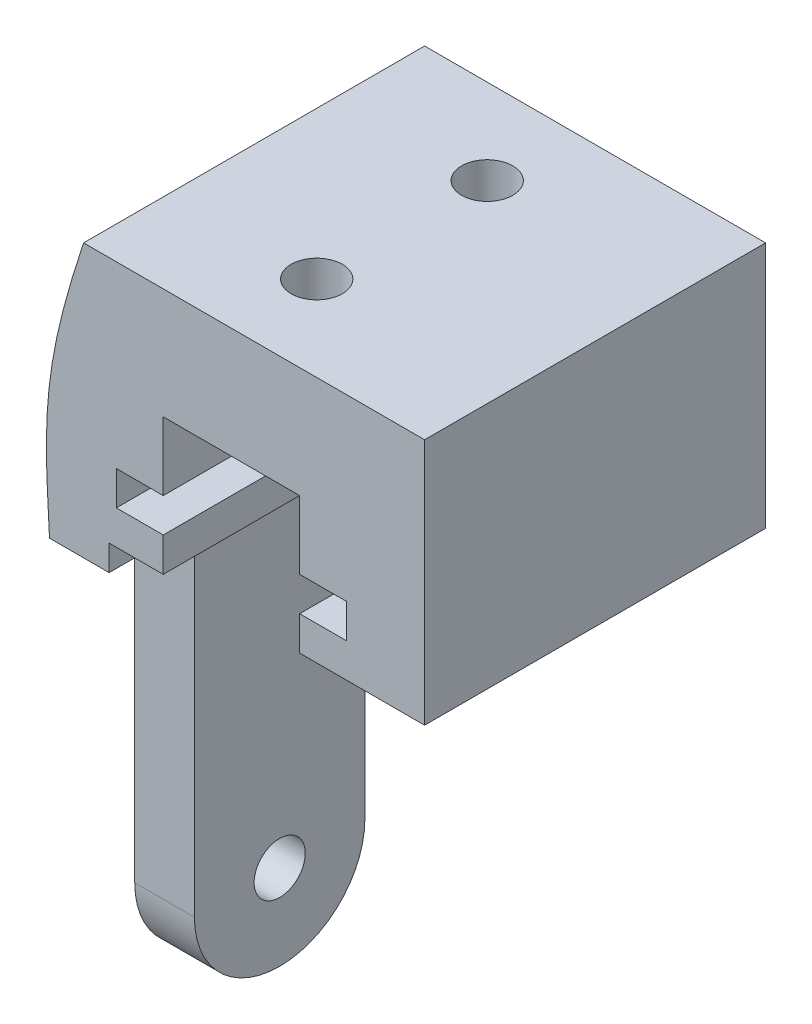
ISO-10303-21;
HEADER;
FILE_DESCRIPTION(('STEP AP214'),'2;1');
FILE_NAME('part.step','',(''),(''),'','','');
FILE_SCHEMA(('AUTOMOTIVE_DESIGN { 1 0 10303 214 1 1 1 1 }'));
ENDSEC;
DATA;
#1=APPLICATION_CONTEXT('core data for automotive mechanical design processes');
#2=APPLICATION_PROTOCOL_DEFINITION('international standard','automotive_design',2000,#1);
#3=PRODUCT_CONTEXT('',#1,'mechanical');
#4=PRODUCT('Part','Part','',(#3));
#5=PRODUCT_RELATED_PRODUCT_CATEGORY('part','',(#4));
#6=PRODUCT_DEFINITION_FORMATION('','',#4);
#7=PRODUCT_DEFINITION_CONTEXT('part definition',#1,'design');
#8=PRODUCT_DEFINITION('design','',#6,#7);
#9=PRODUCT_DEFINITION_SHAPE('','',#8);
#10=(LENGTH_UNIT() NAMED_UNIT(*) SI_UNIT(.MILLI.,.METRE.));
#11=(NAMED_UNIT(*) PLANE_ANGLE_UNIT() SI_UNIT($,.RADIAN.));
#12=(NAMED_UNIT(*) SI_UNIT($,.STERADIAN.) SOLID_ANGLE_UNIT());
#13=UNCERTAINTY_MEASURE_WITH_UNIT(LENGTH_MEASURE(1.E-05),#10,'distance_accuracy_value','');
#14=(GEOMETRIC_REPRESENTATION_CONTEXT(3) GLOBAL_UNCERTAINTY_ASSIGNED_CONTEXT((#13)) GLOBAL_UNIT_ASSIGNED_CONTEXT((#10,
#11,#12)) REPRESENTATION_CONTEXT('',''));
#15=CARTESIAN_POINT('',(0.,0.,0.));
#16=DIRECTION('',(0.,0.,1.));
#17=DIRECTION('',(1.,0.,0.));
#18=AXIS2_PLACEMENT_3D('',#15,#16,#17);
#19=CARTESIAN_POINT('',(-12.,-16.,20.));
#20=DIRECTION('',(0.,1.,0.));
#21=DIRECTION('',(-1.,0.,0.));
#22=AXIS2_PLACEMENT_3D('',#19,#20,#21);
#23=PLANE('',#22);
#24=DIRECTION('',(-1.,0.,0.));
#25=VECTOR('',#24,1.);
#26=CARTESIAN_POINT('',(-12.,-16.,15.));
#27=LINE('',#26,#25);
#28=CARTESIAN_POINT('',(-8.5,-16.,15.));
#29=VERTEX_POINT('',#28);
#30=CARTESIAN_POINT('',(-12.,-16.,15.));
#31=VERTEX_POINT('',#30);
#32=EDGE_CURVE('E217',#29,#31,#27,.T.);
#33=ORIENTED_EDGE('',*,*,#32,.F.);
#34=DIRECTION('',(0.,0.,-1.));
#35=VECTOR('',#34,1.);
#36=CARTESIAN_POINT('',(-8.5,-16.,20.));
#37=LINE('',#36,#35);
#38=CARTESIAN_POINT('',(-8.5,-16.,20.));
#39=VERTEX_POINT('',#38);
#40=EDGE_CURVE('E206',#39,#29,#37,.T.);
#41=ORIENTED_EDGE('',*,*,#40,.F.);
#42=DIRECTION('',(1.,0.,0.));
#43=VECTOR('',#42,1.);
#44=CARTESIAN_POINT('',(-12.,-16.,20.));
#45=LINE('',#44,#43);
#46=CARTESIAN_POINT('',(-12.,-16.,20.));
#47=VERTEX_POINT('',#46);
#48=EDGE_CURVE('E334',#47,#39,#45,.T.);
#49=ORIENTED_EDGE('',*,*,#48,.F.);
#50=DIRECTION('',(0.,0.,-1.));
#51=VECTOR('',#50,1.);
#52=CARTESIAN_POINT('',(-12.,-16.,20.));
#53=LINE('',#52,#51);
#54=EDGE_CURVE('E42',#47,#31,#53,.T.);
#55=ORIENTED_EDGE('',*,*,#54,.T.);
#56=EDGE_LOOP('',(#33,#41,#49,#55));
#57=FACE_BOUND('',#56,.T.);
#58=ADVANCED_FACE('F33',(#57),#23,.F.);
#59=DIRECTION('',(1.,0.,0.));
#60=VECTOR('',#59,1.);
#61=CARTESIAN_POINT('',(-12.,-16.,5.));
#62=LINE('',#61,#60);
#63=CARTESIAN_POINT('',(-12.,-16.,5.));
#64=VERTEX_POINT('',#63);
#65=CARTESIAN_POINT('',(-8.5,-16.,5.));
#66=VERTEX_POINT('',#65);
#67=EDGE_CURVE('E50',#64,#66,#62,.T.);
#68=ORIENTED_EDGE('',*,*,#67,.F.);
#69=CARTESIAN_POINT('',(-12.,-16.,0.));
#70=VERTEX_POINT('',#69);
#71=EDGE_CURVE('E226',#64,#70,#53,.T.);
#72=ORIENTED_EDGE('',*,*,#71,.T.);
#73=DIRECTION('',(1.,0.,0.));
#74=VECTOR('',#73,1.);
#75=CARTESIAN_POINT('',(-12.,-16.,0.));
#76=LINE('',#75,#74);
#77=CARTESIAN_POINT('',(-8.5,-16.,0.));
#78=VERTEX_POINT('',#77);
#79=EDGE_CURVE('E257',#70,#78,#76,.T.);
#80=ORIENTED_EDGE('',*,*,#79,.T.);
#81=EDGE_CURVE('E248',#66,#78,#37,.T.);
#82=ORIENTED_EDGE('',*,*,#81,.F.);
#83=EDGE_LOOP('',(#68,#72,#80,#82));
#84=FACE_BOUND('',#83,.T.);
#85=ADVANCED_FACE('F258',(#84),#23,.F.);
#86=CARTESIAN_POINT('',(-10.,0.,20.));
#87=DIRECTION('',(0.,1.,0.));
#88=DIRECTION('',(-1.,0.,0.));
#89=AXIS2_PLACEMENT_3D('',#86,#87,#88);
#90=PLANE('',#89);
#91=CARTESIAN_POINT('',(-1.32798457884331,0.,5.));
#92=DIRECTION('',(0.,1.,0.));
#93=DIRECTION('',(-1.,0.,0.));
#94=AXIS2_PLACEMENT_3D('',#91,#92,#93);
#95=CIRCLE('',#94,1.5);
#96=CARTESIAN_POINT('',(-2.82798457884331,0.,5.));
#97=VERTEX_POINT('',#96);
#98=EDGE_CURVE('E436',#97,#97,#95,.F.);
#99=ORIENTED_EDGE('',*,*,#98,.T.);
#100=EDGE_LOOP('',(#99));
#101=FACE_BOUND('',#100,.T.);
#102=CARTESIAN_POINT('',(-1.32798457884331,0.,15.));
#103=DIRECTION('',(0.,1.,0.));
#104=DIRECTION('',(-1.,0.,0.));
#105=AXIS2_PLACEMENT_3D('',#102,#103,#104);
#106=CIRCLE('',#105,1.5);
#107=CARTESIAN_POINT('',(-2.82798457884331,0.,15.));
#108=VERTEX_POINT('',#107);
#109=EDGE_CURVE('E429',#108,#108,#106,.F.);
#110=ORIENTED_EDGE('',*,*,#109,.T.);
#111=EDGE_LOOP('',(#110));
#112=FACE_BOUND('',#111,.T.);
#113=DIRECTION('',(1.,0.,0.));
#114=VECTOR('',#113,1.);
#115=CARTESIAN_POINT('',(-10.,0.,0.));
#116=LINE('',#115,#114);
#117=CARTESIAN_POINT('',(-10.,0.,0.));
#118=VERTEX_POINT('',#117);
#119=CARTESIAN_POINT('',(10.,0.,0.));
#120=VERTEX_POINT('',#119);
#121=EDGE_CURVE('E345',#118,#120,#116,.T.);
#122=ORIENTED_EDGE('',*,*,#121,.F.);
#123=DIRECTION('',(0.,0.,-1.));
#124=VECTOR('',#123,1.);
#125=CARTESIAN_POINT('',(-10.,0.,20.));
#126=LINE('',#125,#124);
#127=CARTESIAN_POINT('',(-10.,0.,20.));
#128=VERTEX_POINT('',#127);
#129=EDGE_CURVE('E11',#128,#118,#126,.T.);
#130=ORIENTED_EDGE('',*,*,#129,.F.);
#131=DIRECTION('',(1.,0.,0.));
#132=VECTOR('',#131,1.);
#133=CARTESIAN_POINT('',(-10.,0.,20.));
#134=LINE('',#133,#132);
#135=CARTESIAN_POINT('',(10.,0.,20.));
#136=VERTEX_POINT('',#135);
#137=EDGE_CURVE('E276',#128,#136,#134,.T.);
#138=ORIENTED_EDGE('',*,*,#137,.T.);
#139=DIRECTION('',(0.,0.,-1.));
#140=VECTOR('',#139,1.);
#141=CARTESIAN_POINT('',(10.,0.,20.));
#142=LINE('',#141,#140);
#143=EDGE_CURVE('E287',#136,#120,#142,.T.);
#144=ORIENTED_EDGE('',*,*,#143,.T.);
#145=EDGE_LOOP('',(#122,#130,#138,#144));
#146=FACE_BOUND('',#145,.T.);
#147=ADVANCED_FACE('F35',(#101,#112,#146),#90,.T.);
#148=CARTESIAN_POINT('',(-10.,0.,20.));
#149=CARTESIAN_POINT('',(-12.5766462846211,-7.74056628786684,20.));
#150=CARTESIAN_POINT('',(-12.2842806873499,-10.4923829757877,20.));
#151=CARTESIAN_POINT('',(-12.,-16.,20.));
#152=B_SPLINE_CURVE_WITH_KNOTS('',3,(#148,#149,#150,#151),.UNSPECIFIED.,.F.,.F.,(4,4),(0.,1.),.UNSPECIFIED.);
#153=DIRECTION('',(0.,0.,-1.));
#154=VECTOR('',#153,1.);
#155=SURFACE_OF_LINEAR_EXTRUSION('',#152,#154);
#156=CARTESIAN_POINT('',(-10.,0.,0.));
#157=CARTESIAN_POINT('',(-12.5766462846211,-7.74056628786684,0.));
#158=CARTESIAN_POINT('',(-12.2842806873499,-10.4923829757877,0.));
#159=CARTESIAN_POINT('',(-12.,-16.,0.));
#160=B_SPLINE_CURVE_WITH_KNOTS('',3,(#156,#157,#158,#159),.UNSPECIFIED.,.F.,.F.,(4,4),(0.,1.),.UNSPECIFIED.);
#161=EDGE_CURVE('E262',#118,#70,#160,.T.);
#162=ORIENTED_EDGE('',*,*,#161,.T.);
#163=ORIENTED_EDGE('',*,*,#71,.F.);
#164=DIRECTION('',(0.,0.,-1.));
#165=VECTOR('',#164,1.);
#166=CARTESIAN_POINT('',(-12.,-16.,15.));
#167=LINE('',#166,#165);
#168=EDGE_CURVE('E57',#31,#64,#167,.T.);
#169=ORIENTED_EDGE('',*,*,#168,.F.);
#170=ORIENTED_EDGE('',*,*,#54,.F.);
#171=EDGE_CURVE('E290',#128,#47,#152,.T.);
#172=ORIENTED_EDGE('',*,*,#171,.F.);
#173=ORIENTED_EDGE('',*,*,#129,.T.);
#174=EDGE_LOOP('',(#162,#163,#169,#170,#172,#173));
#175=FACE_BOUND('',#174,.T.);
#176=ADVANCED_FACE('F351',(#175),#155,.F.);
#177=CARTESIAN_POINT('',(-8.5,-16.,20.));
#178=DIRECTION('',(-1.,0.,0.));
#179=DIRECTION('',(0.,0.,1.));
#180=AXIS2_PLACEMENT_3D('',#177,#178,#179);
#181=PLANE('',#180);
#182=CARTESIAN_POINT('',(-8.5,-36.,10.));
#183=DIRECTION('',(-1.,0.,0.));
#184=DIRECTION('',(0.,0.,1.));
#185=AXIS2_PLACEMENT_3D('',#182,#183,#184);
#186=CIRCLE('',#185,1.5);
#187=CARTESIAN_POINT('',(-8.5,-36.,11.5));
#188=VERTEX_POINT('',#187);
#189=EDGE_CURVE('E212',#188,#188,#186,.T.);
#190=ORIENTED_EDGE('',*,*,#189,.T.);
#191=EDGE_LOOP('',(#190));
#192=FACE_BOUND('',#191,.T.);
#193=DIRECTION('',(0.,1.,0.));
#194=VECTOR('',#193,1.);
#195=CARTESIAN_POINT('',(-8.5,-16.,0.));
#196=LINE('',#195,#194);
#197=CARTESIAN_POINT('',(-8.5,-14.5,0.));
#198=VERTEX_POINT('',#197);
#199=EDGE_CURVE('E252',#78,#198,#196,.T.);
#200=ORIENTED_EDGE('',*,*,#199,.T.);
#201=DIRECTION('',(0.,0.,-1.));
#202=VECTOR('',#201,1.);
#203=CARTESIAN_POINT('',(-8.5,-14.5,20.));
#204=LINE('',#203,#202);
#205=CARTESIAN_POINT('',(-8.5,-14.5,20.));
#206=VERTEX_POINT('',#205);
#207=EDGE_CURVE('E254',#206,#198,#204,.T.);
#208=ORIENTED_EDGE('',*,*,#207,.F.);
#209=DIRECTION('',(0.,1.,0.));
#210=VECTOR('',#209,1.);
#211=CARTESIAN_POINT('',(-8.5,-16.,20.));
#212=LINE('',#211,#210);
#213=EDGE_CURVE('E332',#39,#206,#212,.T.);
#214=ORIENTED_EDGE('',*,*,#213,.F.);
#215=ORIENTED_EDGE('',*,*,#40,.T.);
#216=DIRECTION('',(0.,1.,0.));
#217=VECTOR('',#216,1.);
#218=CARTESIAN_POINT('',(-8.50000000000002,-36.,15.));
#219=LINE('',#218,#217);
#220=CARTESIAN_POINT('',(-8.5,-36.,15.));
#221=VERTEX_POINT('',#220);
#222=EDGE_CURVE('E188',#221,#29,#219,.T.);
#223=ORIENTED_EDGE('',*,*,#222,.F.);
#224=CARTESIAN_POINT('',(-8.5,-36.,10.));
#225=DIRECTION('',(-1.,0.,0.));
#226=DIRECTION('',(0.,0.,1.));
#227=AXIS2_PLACEMENT_3D('',#224,#225,#226);
#228=CIRCLE('',#227,5.);
#229=CARTESIAN_POINT('',(-8.50000000000002,-36.,5.));
#230=VERTEX_POINT('',#229);
#231=EDGE_CURVE('E202',#221,#230,#228,.F.);
#232=ORIENTED_EDGE('',*,*,#231,.T.);
#233=DIRECTION('',(0.,1.,0.));
#234=VECTOR('',#233,1.);
#235=CARTESIAN_POINT('',(-8.50000000000002,-36.,5.));
#236=LINE('',#235,#234);
#237=EDGE_CURVE('E207',#230,#66,#236,.T.);
#238=ORIENTED_EDGE('',*,*,#237,.T.);
#239=ORIENTED_EDGE('',*,*,#81,.T.);
#240=EDGE_LOOP('',(#200,#208,#214,#215,#223,#232,#238,#239));
#241=FACE_BOUND('',#240,.T.);
#242=ADVANCED_FACE('F200',(#192,#241),#181,.F.);
#243=CARTESIAN_POINT('',(-8.5,-14.5,20.));
#244=DIRECTION('',(0.,1.,0.));
#245=DIRECTION('',(0.,0.,1.));
#246=AXIS2_PLACEMENT_3D('',#243,#244,#245);
#247=PLANE('',#246);
#248=DIRECTION('',(1.,0.,0.));
#249=VECTOR('',#248,1.);
#250=CARTESIAN_POINT('',(-8.5,-14.5,0.));
#251=LINE('',#250,#249);
#252=CARTESIAN_POINT('',(-5.32798457884331,-14.5,0.));
#253=VERTEX_POINT('',#252);
#254=EDGE_CURVE('E268',#198,#253,#251,.T.);
#255=ORIENTED_EDGE('',*,*,#254,.T.);
#256=DIRECTION('',(0.,0.,-1.));
#257=VECTOR('',#256,1.);
#258=CARTESIAN_POINT('',(-5.32798457884331,-14.5,20.));
#259=LINE('',#258,#257);
#260=CARTESIAN_POINT('',(-5.32798457884331,-14.5,20.));
#261=VERTEX_POINT('',#260);
#262=EDGE_CURVE('E325',#261,#253,#259,.T.);
#263=ORIENTED_EDGE('',*,*,#262,.F.);
#264=DIRECTION('',(1.,0.,0.));
#265=VECTOR('',#264,1.);
#266=CARTESIAN_POINT('',(-8.5,-14.5,20.));
#267=LINE('',#266,#265);
#268=EDGE_CURVE('E331',#206,#261,#267,.T.);
#269=ORIENTED_EDGE('',*,*,#268,.F.);
#270=ORIENTED_EDGE('',*,*,#207,.T.);
#271=EDGE_LOOP('',(#255,#263,#269,#270));
#272=FACE_BOUND('',#271,.T.);
#273=ADVANCED_FACE('F329',(#272),#247,.F.);
#274=CARTESIAN_POINT('',(-5.32798457884331,-14.5,20.));
#275=DIRECTION('',(-1.,0.,0.));
#276=DIRECTION('',(0.,0.,1.));
#277=AXIS2_PLACEMENT_3D('',#274,#275,#276);
#278=PLANE('',#277);
#279=DIRECTION('',(0.,1.,0.));
#280=VECTOR('',#279,1.);
#281=CARTESIAN_POINT('',(-5.32798457884331,-14.5,0.));
#282=LINE('',#281,#280);
#283=CARTESIAN_POINT('',(-5.32798457884331,-12.5,0.));
#284=VERTEX_POINT('',#283);
#285=EDGE_CURVE('E270',#253,#284,#282,.T.);
#286=ORIENTED_EDGE('',*,*,#285,.T.);
#287=DIRECTION('',(0.,0.,-1.));
#288=VECTOR('',#287,1.);
#289=CARTESIAN_POINT('',(-5.32798457884331,-12.5,20.));
#290=LINE('',#289,#288);
#291=CARTESIAN_POINT('',(-5.32798457884331,-12.5,20.));
#292=VERTEX_POINT('',#291);
#293=EDGE_CURVE('E322',#292,#284,#290,.T.);
#294=ORIENTED_EDGE('',*,*,#293,.F.);
#295=DIRECTION('',(0.,1.,0.));
#296=VECTOR('',#295,1.);
#297=CARTESIAN_POINT('',(-5.32798457884331,-14.5,20.));
#298=LINE('',#297,#296);
#299=EDGE_CURVE('E337',#261,#292,#298,.T.);
#300=ORIENTED_EDGE('',*,*,#299,.F.);
#301=ORIENTED_EDGE('',*,*,#262,.T.);
#302=EDGE_LOOP('',(#286,#294,#300,#301));
#303=FACE_BOUND('',#302,.T.);
#304=ADVANCED_FACE('F364',(#303),#278,.F.);
#305=CARTESIAN_POINT('',(-5.32798457884331,-12.5,20.));
#306=DIRECTION('',(0.,-1.,0.));
#307=DIRECTION('',(1.,0.,0.));
#308=AXIS2_PLACEMENT_3D('',#305,#306,#307);
#309=PLANE('',#308);
#310=DIRECTION('',(-1.,0.,0.));
#311=VECTOR('',#310,1.);
#312=CARTESIAN_POINT('',(-5.32798457884331,-12.5,0.));
#313=LINE('',#312,#311);
#314=CARTESIAN_POINT('',(-8.07798457884331,-12.5,0.));
#315=VERTEX_POINT('',#314);
#316=EDGE_CURVE('E472',#284,#315,#313,.T.);
#317=ORIENTED_EDGE('',*,*,#316,.T.);
#318=DIRECTION('',(0.,0.,-1.));
#319=VECTOR('',#318,1.);
#320=CARTESIAN_POINT('',(-8.07798457884331,-12.5,20.));
#321=LINE('',#320,#319);
#322=CARTESIAN_POINT('',(-8.07798457884331,-12.5,20.));
#323=VERTEX_POINT('',#322);
#324=EDGE_CURVE('E319',#323,#315,#321,.T.);
#325=ORIENTED_EDGE('',*,*,#324,.F.);
#326=DIRECTION('',(-1.,0.,0.));
#327=VECTOR('',#326,1.);
#328=CARTESIAN_POINT('',(-5.32798457884331,-12.5,20.));
#329=LINE('',#328,#327);
#330=EDGE_CURVE('E464',#292,#323,#329,.T.);
#331=ORIENTED_EDGE('',*,*,#330,.F.);
#332=ORIENTED_EDGE('',*,*,#293,.T.);
#333=EDGE_LOOP('',(#317,#325,#331,#332));
#334=FACE_BOUND('',#333,.T.);
#335=ADVANCED_FACE('F367',(#334),#309,.F.);
#336=CARTESIAN_POINT('',(-8.07798457884331,-12.5,20.));
#337=DIRECTION('',(-1.,0.,0.));
#338=DIRECTION('',(0.,0.,1.));
#339=AXIS2_PLACEMENT_3D('',#336,#337,#338);
#340=PLANE('',#339);
#341=DIRECTION('',(0.,1.,0.));
#342=VECTOR('',#341,1.);
#343=CARTESIAN_POINT('',(-8.07798457884331,-12.5,0.));
#344=LINE('',#343,#342);
#345=CARTESIAN_POINT('',(-8.07798457884331,-10.5,0.));
#346=VERTEX_POINT('',#345);
#347=EDGE_CURVE('E735',#315,#346,#344,.T.);
#348=ORIENTED_EDGE('',*,*,#347,.T.);
#349=DIRECTION('',(0.,0.,-1.));
#350=VECTOR('',#349,1.);
#351=CARTESIAN_POINT('',(-8.07798457884331,-10.5,20.));
#352=LINE('',#351,#350);
#353=CARTESIAN_POINT('',(-8.07798457884331,-10.5,20.));
#354=VERTEX_POINT('',#353);
#355=EDGE_CURVE('E316',#354,#346,#352,.T.);
#356=ORIENTED_EDGE('',*,*,#355,.F.);
#357=DIRECTION('',(0.,1.,0.));
#358=VECTOR('',#357,1.);
#359=CARTESIAN_POINT('',(-8.07798457884331,-12.5,20.));
#360=LINE('',#359,#358);
#361=EDGE_CURVE('E462',#323,#354,#360,.T.);
#362=ORIENTED_EDGE('',*,*,#361,.F.);
#363=ORIENTED_EDGE('',*,*,#324,.T.);
#364=EDGE_LOOP('',(#348,#356,#362,#363));
#365=FACE_BOUND('',#364,.T.);
#366=ADVANCED_FACE('F371',(#365),#340,.F.);
#367=CARTESIAN_POINT('',(-8.07798457884331,-10.5,20.));
#368=DIRECTION('',(0.,1.,0.));
#369=DIRECTION('',(0.,0.,1.));
#370=AXIS2_PLACEMENT_3D('',#367,#368,#369);
#371=PLANE('',#370);
#372=DIRECTION('',(1.,0.,0.));
#373=VECTOR('',#372,1.);
#374=CARTESIAN_POINT('',(-8.07798457884331,-10.5,0.));
#375=LINE('',#374,#373);
#376=CARTESIAN_POINT('',(-5.32798457884331,-10.5,0.));
#377=VERTEX_POINT('',#376);
#378=EDGE_CURVE('E480',#346,#377,#375,.T.);
#379=ORIENTED_EDGE('',*,*,#378,.T.);
#380=DIRECTION('',(0.,0.,-1.));
#381=VECTOR('',#380,1.);
#382=CARTESIAN_POINT('',(-5.32798457884331,-10.5,20.));
#383=LINE('',#382,#381);
#384=CARTESIAN_POINT('',(-5.32798457884331,-10.5,20.));
#385=VERTEX_POINT('',#384);
#386=EDGE_CURVE('E313',#385,#377,#383,.T.);
#387=ORIENTED_EDGE('',*,*,#386,.F.);
#388=DIRECTION('',(1.,0.,0.));
#389=VECTOR('',#388,1.);
#390=CARTESIAN_POINT('',(-8.07798457884331,-10.5,20.));
#391=LINE('',#390,#389);
#392=EDGE_CURVE('E460',#354,#385,#391,.T.);
#393=ORIENTED_EDGE('',*,*,#392,.F.);
#394=ORIENTED_EDGE('',*,*,#355,.T.);
#395=EDGE_LOOP('',(#379,#387,#393,#394));
#396=FACE_BOUND('',#395,.T.);
#397=ADVANCED_FACE('F375',(#396),#371,.F.);
#398=CARTESIAN_POINT('',(-5.32798457884331,-10.5,20.));
#399=DIRECTION('',(-1.,0.,0.));
#400=DIRECTION('',(0.,0.,1.));
#401=AXIS2_PLACEMENT_3D('',#398,#399,#400);
#402=PLANE('',#401);
#403=DIRECTION('',(0.,1.,0.));
#404=VECTOR('',#403,1.);
#405=CARTESIAN_POINT('',(-5.32798457884331,-10.5,0.));
#406=LINE('',#405,#404);
#407=CARTESIAN_POINT('',(-5.32798457884331,-6.5,0.));
#408=VERTEX_POINT('',#407);
#409=EDGE_CURVE('E483',#377,#408,#406,.T.);
#410=ORIENTED_EDGE('',*,*,#409,.T.);
#411=DIRECTION('',(0.,0.,-1.));
#412=VECTOR('',#411,1.);
#413=CARTESIAN_POINT('',(-5.32798457884331,-6.5,20.));
#414=LINE('',#413,#412);
#415=CARTESIAN_POINT('',(-5.32798457884331,-6.5,20.));
#416=VERTEX_POINT('',#415);
#417=EDGE_CURVE('E310',#416,#408,#414,.T.);
#418=ORIENTED_EDGE('',*,*,#417,.F.);
#419=DIRECTION('',(0.,1.,0.));
#420=VECTOR('',#419,1.);
#421=CARTESIAN_POINT('',(-5.32798457884331,-10.5,20.));
#422=LINE('',#421,#420);
#423=EDGE_CURVE('E458',#385,#416,#422,.T.);
#424=ORIENTED_EDGE('',*,*,#423,.F.);
#425=ORIENTED_EDGE('',*,*,#386,.T.);
#426=EDGE_LOOP('',(#410,#418,#424,#425));
#427=FACE_BOUND('',#426,.T.);
#428=ADVANCED_FACE('F379',(#427),#402,.F.);
#429=CARTESIAN_POINT('',(-5.32798457884331,-6.5,20.));
#430=DIRECTION('',(0.,1.,0.));
#431=DIRECTION('',(-1.,0.,0.));
#432=AXIS2_PLACEMENT_3D('',#429,#430,#431);
#433=PLANE('',#432);
#434=CARTESIAN_POINT('',(-1.32798457884331,-6.5,5.));
#435=DIRECTION('',(0.,-1.,0.));
#436=DIRECTION('',(1.,0.,0.));
#437=AXIS2_PLACEMENT_3D('',#434,#435,#436);
#438=CIRCLE('',#437,1.5);
#439=CARTESIAN_POINT('',(0.172015421156694,-6.5,5.));
#440=VERTEX_POINT('',#439);
#441=EDGE_CURVE('E235',#440,#440,#438,.T.);
#442=ORIENTED_EDGE('',*,*,#441,.F.);
#443=EDGE_LOOP('',(#442));
#444=FACE_BOUND('',#443,.T.);
#445=CARTESIAN_POINT('',(-1.32798457884331,-6.5,15.));
#446=DIRECTION('',(0.,-1.,0.));
#447=DIRECTION('',(1.,0.,0.));
#448=AXIS2_PLACEMENT_3D('',#445,#446,#447);
#449=CIRCLE('',#448,1.5);
#450=CARTESIAN_POINT('',(0.172015421156694,-6.5,15.));
#451=VERTEX_POINT('',#450);
#452=EDGE_CURVE('E431',#451,#451,#449,.T.);
#453=ORIENTED_EDGE('',*,*,#452,.F.);
#454=EDGE_LOOP('',(#453));
#455=FACE_BOUND('',#454,.T.);
#456=DIRECTION('',(1.,0.,0.));
#457=VECTOR('',#456,1.);
#458=CARTESIAN_POINT('',(-5.32798457884331,-6.5,0.));
#459=LINE('',#458,#457);
#460=CARTESIAN_POINT('',(2.67201542115669,-6.5,0.));
#461=VERTEX_POINT('',#460);
#462=EDGE_CURVE('E731',#408,#461,#459,.T.);
#463=ORIENTED_EDGE('',*,*,#462,.T.);
#464=DIRECTION('',(0.,0.,-1.));
#465=VECTOR('',#464,1.);
#466=CARTESIAN_POINT('',(2.67201542115669,-6.5,20.));
#467=LINE('',#466,#465);
#468=CARTESIAN_POINT('',(2.67201542115669,-6.5,20.));
#469=VERTEX_POINT('',#468);
#470=EDGE_CURVE('E307',#469,#461,#467,.T.);
#471=ORIENTED_EDGE('',*,*,#470,.F.);
#472=DIRECTION('',(1.,0.,0.));
#473=VECTOR('',#472,1.);
#474=CARTESIAN_POINT('',(-5.32798457884331,-6.5,20.));
#475=LINE('',#474,#473);
#476=EDGE_CURVE('E456',#416,#469,#475,.T.);
#477=ORIENTED_EDGE('',*,*,#476,.F.);
#478=ORIENTED_EDGE('',*,*,#417,.T.);
#479=EDGE_LOOP('',(#463,#471,#477,#478));
#480=FACE_BOUND('',#479,.T.);
#481=ADVANCED_FACE('F383',(#444,#455,#480),#433,.F.);
#482=CARTESIAN_POINT('',(2.67201542115669,-6.5,20.));
#483=DIRECTION('',(1.,0.,0.));
#484=DIRECTION('',(0.,1.,0.));
#485=AXIS2_PLACEMENT_3D('',#482,#483,#484);
#486=PLANE('',#485);
#487=DIRECTION('',(0.,-1.,0.));
#488=VECTOR('',#487,1.);
#489=CARTESIAN_POINT('',(2.67201542115669,-6.5,0.));
#490=LINE('',#489,#488);
#491=CARTESIAN_POINT('',(2.67201542115669,-10.5,0.));
#492=VERTEX_POINT('',#491);
#493=EDGE_CURVE('E492',#461,#492,#490,.T.);
#494=ORIENTED_EDGE('',*,*,#493,.T.);
#495=DIRECTION('',(0.,0.,-1.));
#496=VECTOR('',#495,1.);
#497=CARTESIAN_POINT('',(2.67201542115669,-10.5,20.));
#498=LINE('',#497,#496);
#499=CARTESIAN_POINT('',(2.67201542115669,-10.5,20.));
#500=VERTEX_POINT('',#499);
#501=EDGE_CURVE('E304',#500,#492,#498,.T.);
#502=ORIENTED_EDGE('',*,*,#501,.F.);
#503=DIRECTION('',(0.,-1.,0.));
#504=VECTOR('',#503,1.);
#505=CARTESIAN_POINT('',(2.67201542115669,-6.5,20.));
#506=LINE('',#505,#504);
#507=EDGE_CURVE('E454',#469,#500,#506,.T.);
#508=ORIENTED_EDGE('',*,*,#507,.F.);
#509=ORIENTED_EDGE('',*,*,#470,.T.);
#510=EDGE_LOOP('',(#494,#502,#508,#509));
#511=FACE_BOUND('',#510,.T.);
#512=ADVANCED_FACE('F387',(#511),#486,.F.);
#513=CARTESIAN_POINT('',(2.67201542115669,-10.5,20.));
#514=DIRECTION('',(0.,1.,0.));
#515=DIRECTION('',(0.,0.,1.));
#516=AXIS2_PLACEMENT_3D('',#513,#514,#515);
#517=PLANE('',#516);
#518=DIRECTION('',(1.,0.,0.));
#519=VECTOR('',#518,1.);
#520=CARTESIAN_POINT('',(2.67201542115669,-10.5,0.));
#521=LINE('',#520,#519);
#522=CARTESIAN_POINT('',(5.42201542115669,-10.5,0.));
#523=VERTEX_POINT('',#522);
#524=EDGE_CURVE('E495',#492,#523,#521,.T.);
#525=ORIENTED_EDGE('',*,*,#524,.T.);
#526=DIRECTION('',(0.,0.,-1.));
#527=VECTOR('',#526,1.);
#528=CARTESIAN_POINT('',(5.42201542115669,-10.5,20.));
#529=LINE('',#528,#527);
#530=CARTESIAN_POINT('',(5.42201542115669,-10.5,20.));
#531=VERTEX_POINT('',#530);
#532=EDGE_CURVE('E301',#531,#523,#529,.T.);
#533=ORIENTED_EDGE('',*,*,#532,.F.);
#534=DIRECTION('',(1.,0.,0.));
#535=VECTOR('',#534,1.);
#536=CARTESIAN_POINT('',(2.67201542115669,-10.5,20.));
#537=LINE('',#536,#535);
#538=EDGE_CURVE('E452',#500,#531,#537,.T.);
#539=ORIENTED_EDGE('',*,*,#538,.F.);
#540=ORIENTED_EDGE('',*,*,#501,.T.);
#541=EDGE_LOOP('',(#525,#533,#539,#540));
#542=FACE_BOUND('',#541,.T.);
#543=ADVANCED_FACE('F391',(#542),#517,.F.);
#544=CARTESIAN_POINT('',(5.42201542115669,-10.5,20.));
#545=DIRECTION('',(1.,0.,0.));
#546=DIRECTION('',(0.,0.,-1.));
#547=AXIS2_PLACEMENT_3D('',#544,#545,#546);
#548=PLANE('',#547);
#549=DIRECTION('',(0.,-1.,0.));
#550=VECTOR('',#549,1.);
#551=CARTESIAN_POINT('',(5.42201542115669,-10.5,0.));
#552=LINE('',#551,#550);
#553=CARTESIAN_POINT('',(5.42201542115669,-12.5,0.));
#554=VERTEX_POINT('',#553);
#555=EDGE_CURVE('E727',#523,#554,#552,.T.);
#556=ORIENTED_EDGE('',*,*,#555,.T.);
#557=DIRECTION('',(0.,0.,-1.));
#558=VECTOR('',#557,1.);
#559=CARTESIAN_POINT('',(5.42201542115669,-12.5,20.));
#560=LINE('',#559,#558);
#561=CARTESIAN_POINT('',(5.42201542115669,-12.5,20.));
#562=VERTEX_POINT('',#561);
#563=EDGE_CURVE('E298',#562,#554,#560,.T.);
#564=ORIENTED_EDGE('',*,*,#563,.F.);
#565=DIRECTION('',(0.,-1.,0.));
#566=VECTOR('',#565,1.);
#567=CARTESIAN_POINT('',(5.42201542115669,-10.5,20.));
#568=LINE('',#567,#566);
#569=EDGE_CURVE('E450',#531,#562,#568,.T.);
#570=ORIENTED_EDGE('',*,*,#569,.F.);
#571=ORIENTED_EDGE('',*,*,#532,.T.);
#572=EDGE_LOOP('',(#556,#564,#570,#571));
#573=FACE_BOUND('',#572,.T.);
#574=ADVANCED_FACE('F395',(#573),#548,.F.);
#575=CARTESIAN_POINT('',(5.42201542115669,-12.5,20.));
#576=DIRECTION('',(0.,-1.,0.));
#577=DIRECTION('',(0.,0.,-1.));
#578=AXIS2_PLACEMENT_3D('',#575,#576,#577);
#579=PLANE('',#578);
#580=DIRECTION('',(-1.,0.,0.));
#581=VECTOR('',#580,1.);
#582=CARTESIAN_POINT('',(5.42201542115669,-12.5,0.));
#583=LINE('',#582,#581);
#584=CARTESIAN_POINT('',(2.67201542115669,-12.5,0.));
#585=VERTEX_POINT('',#584);
#586=EDGE_CURVE('E503',#554,#585,#583,.T.);
#587=ORIENTED_EDGE('',*,*,#586,.T.);
#588=DIRECTION('',(0.,0.,-1.));
#589=VECTOR('',#588,1.);
#590=CARTESIAN_POINT('',(2.67201542115669,-12.5,20.));
#591=LINE('',#590,#589);
#592=CARTESIAN_POINT('',(2.67201542115669,-12.5,20.));
#593=VERTEX_POINT('',#592);
#594=EDGE_CURVE('E295',#593,#585,#591,.T.);
#595=ORIENTED_EDGE('',*,*,#594,.F.);
#596=DIRECTION('',(-1.,0.,0.));
#597=VECTOR('',#596,1.);
#598=CARTESIAN_POINT('',(5.42201542115669,-12.5,20.));
#599=LINE('',#598,#597);
#600=EDGE_CURVE('E448',#562,#593,#599,.T.);
#601=ORIENTED_EDGE('',*,*,#600,.F.);
#602=ORIENTED_EDGE('',*,*,#563,.T.);
#603=EDGE_LOOP('',(#587,#595,#601,#602));
#604=FACE_BOUND('',#603,.T.);
#605=ADVANCED_FACE('F399',(#604),#579,.F.);
#606=CARTESIAN_POINT('',(2.67201542115669,-12.5,20.));
#607=DIRECTION('',(1.,0.,0.));
#608=DIRECTION('',(0.,0.,-1.));
#609=AXIS2_PLACEMENT_3D('',#606,#607,#608);
#610=PLANE('',#609);
#611=DIRECTION('',(0.,-1.,0.));
#612=VECTOR('',#611,1.);
#613=CARTESIAN_POINT('',(2.67201542115669,-12.5,0.));
#614=LINE('',#613,#612);
#615=CARTESIAN_POINT('',(2.67201542115669,-14.5,0.));
#616=VERTEX_POINT('',#615);
#617=EDGE_CURVE('E506',#585,#616,#614,.T.);
#618=ORIENTED_EDGE('',*,*,#617,.T.);
#619=DIRECTION('',(0.,0.,-1.));
#620=VECTOR('',#619,1.);
#621=CARTESIAN_POINT('',(2.67201542115669,-14.5,20.));
#622=LINE('',#621,#620);
#623=CARTESIAN_POINT('',(2.67201542115669,-14.5,20.));
#624=VERTEX_POINT('',#623);
#625=EDGE_CURVE('E292',#624,#616,#622,.T.);
#626=ORIENTED_EDGE('',*,*,#625,.F.);
#627=DIRECTION('',(0.,-1.,0.));
#628=VECTOR('',#627,1.);
#629=CARTESIAN_POINT('',(2.67201542115669,-12.5,20.));
#630=LINE('',#629,#628);
#631=EDGE_CURVE('E446',#593,#624,#630,.T.);
#632=ORIENTED_EDGE('',*,*,#631,.F.);
#633=ORIENTED_EDGE('',*,*,#594,.T.);
#634=EDGE_LOOP('',(#618,#626,#632,#633));
#635=FACE_BOUND('',#634,.T.);
#636=ADVANCED_FACE('F403',(#635),#610,.F.);
#637=CARTESIAN_POINT('',(2.67201542115669,-14.5,20.));
#638=DIRECTION('',(0.,1.,0.));
#639=DIRECTION('',(0.,0.,1.));
#640=AXIS2_PLACEMENT_3D('',#637,#638,#639);
#641=PLANE('',#640);
#642=DIRECTION('',(1.,0.,0.));
#643=VECTOR('',#642,1.);
#644=CARTESIAN_POINT('',(2.67201542115669,-14.5,0.));
#645=LINE('',#644,#643);
#646=CARTESIAN_POINT('',(10.,-14.5,0.));
#647=VERTEX_POINT('',#646);
#648=EDGE_CURVE('E426',#616,#647,#645,.T.);
#649=ORIENTED_EDGE('',*,*,#648,.T.);
#650=DIRECTION('',(0.,0.,-1.));
#651=VECTOR('',#650,1.);
#652=CARTESIAN_POINT('',(10.,-14.5,20.));
#653=LINE('',#652,#651);
#654=CARTESIAN_POINT('',(10.,-14.5,20.));
#655=VERTEX_POINT('',#654);
#656=EDGE_CURVE('E289',#655,#647,#653,.T.);
#657=ORIENTED_EDGE('',*,*,#656,.F.);
#658=DIRECTION('',(1.,0.,0.));
#659=VECTOR('',#658,1.);
#660=CARTESIAN_POINT('',(2.67201542115669,-14.5,20.));
#661=LINE('',#660,#659);
#662=EDGE_CURVE('E444',#624,#655,#661,.T.);
#663=ORIENTED_EDGE('',*,*,#662,.F.);
#664=ORIENTED_EDGE('',*,*,#625,.T.);
#665=EDGE_LOOP('',(#649,#657,#663,#664));
#666=FACE_BOUND('',#665,.T.);
#667=ADVANCED_FACE('F407',(#666),#641,.F.);
#668=CARTESIAN_POINT('',(10.,0.,20.));
#669=DIRECTION('',(1.,0.,0.));
#670=DIRECTION('',(0.,1.,0.));
#671=AXIS2_PLACEMENT_3D('',#668,#669,#670);
#672=PLANE('',#671);
#673=DIRECTION('',(0.,-1.,0.));
#674=VECTOR('',#673,1.);
#675=CARTESIAN_POINT('',(10.,0.,0.));
#676=LINE('',#675,#674);
#677=EDGE_CURVE('E420',#120,#647,#676,.T.);
#678=ORIENTED_EDGE('',*,*,#677,.F.);
#679=ORIENTED_EDGE('',*,*,#143,.F.);
#680=DIRECTION('',(0.,-1.,0.));
#681=VECTOR('',#680,1.);
#682=CARTESIAN_POINT('',(10.,0.,20.));
#683=LINE('',#682,#681);
#684=EDGE_CURVE('E442',#136,#655,#683,.T.);
#685=ORIENTED_EDGE('',*,*,#684,.T.);
#686=ORIENTED_EDGE('',*,*,#656,.T.);
#687=EDGE_LOOP('',(#678,#679,#685,#686));
#688=FACE_BOUND('',#687,.T.);
#689=ADVANCED_FACE('F410',(#688),#672,.T.);
#690=CARTESIAN_POINT('',(-12.0728476144891,-8.83735597387044,20.));
#691=DIRECTION('',(0.,0.,-1.));
#692=DIRECTION('',(-1.,0.,0.));
#693=AXIS2_PLACEMENT_3D('',#690,#691,#692);
#694=PLANE('',#693);
#695=ORIENTED_EDGE('',*,*,#137,.F.);
#696=ORIENTED_EDGE('',*,*,#171,.T.);
#697=ORIENTED_EDGE('',*,*,#48,.T.);
#698=ORIENTED_EDGE('',*,*,#213,.T.);
#699=ORIENTED_EDGE('',*,*,#268,.T.);
#700=ORIENTED_EDGE('',*,*,#299,.T.);
#701=ORIENTED_EDGE('',*,*,#330,.T.);
#702=ORIENTED_EDGE('',*,*,#361,.T.);
#703=ORIENTED_EDGE('',*,*,#392,.T.);
#704=ORIENTED_EDGE('',*,*,#423,.T.);
#705=ORIENTED_EDGE('',*,*,#476,.T.);
#706=ORIENTED_EDGE('',*,*,#507,.T.);
#707=ORIENTED_EDGE('',*,*,#538,.T.);
#708=ORIENTED_EDGE('',*,*,#569,.T.);
#709=ORIENTED_EDGE('',*,*,#600,.T.);
#710=ORIENTED_EDGE('',*,*,#631,.T.);
#711=ORIENTED_EDGE('',*,*,#662,.T.);
#712=ORIENTED_EDGE('',*,*,#684,.F.);
#713=EDGE_LOOP('',(#695,#696,#697,#698,#699,#700,#701,#702,#703,#704,#705,#706,#707,#708,#709,
#710,#711,#712));
#714=FACE_BOUND('',#713,.T.);
#715=ADVANCED_FACE('F413',(#714),#694,.F.);
#716=CARTESIAN_POINT('',(-12.0728476144891,-8.83735597387044,0.));
#717=DIRECTION('',(0.,0.,-1.));
#718=DIRECTION('',(-1.,0.,0.));
#719=AXIS2_PLACEMENT_3D('',#716,#717,#718);
#720=PLANE('',#719);
#721=ORIENTED_EDGE('',*,*,#121,.T.);
#722=ORIENTED_EDGE('',*,*,#677,.T.);
#723=ORIENTED_EDGE('',*,*,#648,.F.);
#724=ORIENTED_EDGE('',*,*,#617,.F.);
#725=ORIENTED_EDGE('',*,*,#586,.F.);
#726=ORIENTED_EDGE('',*,*,#555,.F.);
#727=ORIENTED_EDGE('',*,*,#524,.F.);
#728=ORIENTED_EDGE('',*,*,#493,.F.);
#729=ORIENTED_EDGE('',*,*,#462,.F.);
#730=ORIENTED_EDGE('',*,*,#409,.F.);
#731=ORIENTED_EDGE('',*,*,#378,.F.);
#732=ORIENTED_EDGE('',*,*,#347,.F.);
#733=ORIENTED_EDGE('',*,*,#316,.F.);
#734=ORIENTED_EDGE('',*,*,#285,.F.);
#735=ORIENTED_EDGE('',*,*,#254,.F.);
#736=ORIENTED_EDGE('',*,*,#199,.F.);
#737=ORIENTED_EDGE('',*,*,#79,.F.);
#738=ORIENTED_EDGE('',*,*,#161,.F.);
#739=EDGE_LOOP('',(#721,#722,#723,#724,#725,#726,#727,#728,#729,#730,#731,#732,#733,#734,#735,
#736,#737,#738));
#740=FACE_BOUND('',#739,.T.);
#741=ADVANCED_FACE('F266',(#740),#720,.T.);
#742=CARTESIAN_POINT('',(-1.32798457884331,4.24264068711929,15.));
#743=DIRECTION('',(0.,-1.,0.));
#744=DIRECTION('',(1.,0.,0.));
#745=AXIS2_PLACEMENT_3D('',#742,#743,#744);
#746=CYLINDRICAL_SURFACE('',#745,1.5);
#747=ORIENTED_EDGE('',*,*,#452,.T.);
#748=EDGE_LOOP('',(#747));
#749=FACE_BOUND('',#748,.T.);
#750=ORIENTED_EDGE('',*,*,#109,.F.);
#751=EDGE_LOOP('',(#750));
#752=FACE_BOUND('',#751,.T.);
#753=ADVANCED_FACE('F524',(#749,#752),#746,.F.);
#754=CARTESIAN_POINT('',(-1.32798457884331,4.24264068711929,5.));
#755=DIRECTION('',(0.,-1.,0.));
#756=DIRECTION('',(1.,0.,0.));
#757=AXIS2_PLACEMENT_3D('',#754,#755,#756);
#758=CYLINDRICAL_SURFACE('',#757,1.5);
#759=ORIENTED_EDGE('',*,*,#441,.T.);
#760=EDGE_LOOP('',(#759));
#761=FACE_BOUND('',#760,.T.);
#762=ORIENTED_EDGE('',*,*,#98,.F.);
#763=EDGE_LOOP('',(#762));
#764=FACE_BOUND('',#763,.T.);
#765=ADVANCED_FACE('F520',(#761,#764),#758,.F.);
#766=CARTESIAN_POINT('',(-12.,-36.,15.));
#767=DIRECTION('',(1.,0.,0.));
#768=DIRECTION('',(0.,1.,0.));
#769=AXIS2_PLACEMENT_3D('',#766,#767,#768);
#770=PLANE('',#769);
#771=CARTESIAN_POINT('',(-12.,-36.,10.));
#772=DIRECTION('',(-1.,0.,0.));
#773=DIRECTION('',(0.,-1.,0.));
#774=AXIS2_PLACEMENT_3D('',#771,#772,#773);
#775=CIRCLE('',#774,1.5);
#776=CARTESIAN_POINT('',(-12.,-37.5,10.));
#777=VERTEX_POINT('',#776);
#778=EDGE_CURVE('E551',#777,#777,#775,.T.);
#779=ORIENTED_EDGE('',*,*,#778,.F.);
#780=EDGE_LOOP('',(#779));
#781=FACE_BOUND('',#780,.T.);
#782=ORIENTED_EDGE('',*,*,#168,.T.);
#783=DIRECTION('',(0.,1.,0.));
#784=VECTOR('',#783,1.);
#785=CARTESIAN_POINT('',(-12.,-36.,5.));
#786=LINE('',#785,#784);
#787=CARTESIAN_POINT('',(-12.,-36.,5.));
#788=VERTEX_POINT('',#787);
#789=EDGE_CURVE('E230',#788,#64,#786,.T.);
#790=ORIENTED_EDGE('',*,*,#789,.F.);
#791=CARTESIAN_POINT('',(-12.,-36.,10.));
#792=DIRECTION('',(-1.,0.,0.));
#793=DIRECTION('',(0.,-1.,0.));
#794=AXIS2_PLACEMENT_3D('',#791,#792,#793);
#795=CIRCLE('',#794,5.);
#796=CARTESIAN_POINT('',(-12.,-36.,15.));
#797=VERTEX_POINT('',#796);
#798=EDGE_CURVE('E209',#788,#797,#795,.T.);
#799=ORIENTED_EDGE('',*,*,#798,.T.);
#800=DIRECTION('',(0.,1.,0.));
#801=VECTOR('',#800,1.);
#802=CARTESIAN_POINT('',(-12.,-36.,15.));
#803=LINE('',#802,#801);
#804=EDGE_CURVE('E190',#797,#31,#803,.T.);
#805=ORIENTED_EDGE('',*,*,#804,.T.);
#806=EDGE_LOOP('',(#782,#790,#799,#805));
#807=FACE_BOUND('',#806,.T.);
#808=ADVANCED_FACE('F244',(#781,#807),#770,.F.);
#809=CARTESIAN_POINT('',(-12.,-36.,5.));
#810=DIRECTION('',(0.,0.,1.));
#811=DIRECTION('',(1.,0.,0.));
#812=AXIS2_PLACEMENT_3D('',#809,#810,#811);
#813=PLANE('',#812);
#814=ORIENTED_EDGE('',*,*,#67,.T.);
#815=ORIENTED_EDGE('',*,*,#237,.F.);
#816=DIRECTION('',(1.,0.,0.));
#817=VECTOR('',#816,1.);
#818=CARTESIAN_POINT('',(-12.,-36.,5.));
#819=LINE('',#818,#817);
#820=EDGE_CURVE('E195',#788,#230,#819,.T.);
#821=ORIENTED_EDGE('',*,*,#820,.F.);
#822=ORIENTED_EDGE('',*,*,#789,.T.);
#823=EDGE_LOOP('',(#814,#815,#821,#822));
#824=FACE_BOUND('',#823,.T.);
#825=ADVANCED_FACE('F247',(#824),#813,.F.);
#826=CARTESIAN_POINT('',(-12.,-36.,15.));
#827=DIRECTION('',(0.,0.,-1.));
#828=DIRECTION('',(-1.,0.,0.));
#829=AXIS2_PLACEMENT_3D('',#826,#827,#828);
#830=PLANE('',#829);
#831=ORIENTED_EDGE('',*,*,#32,.T.);
#832=ORIENTED_EDGE('',*,*,#804,.F.);
#833=DIRECTION('',(-1.,0.,0.));
#834=VECTOR('',#833,1.);
#835=CARTESIAN_POINT('',(-12.,-36.,15.));
#836=LINE('',#835,#834);
#837=EDGE_CURVE('E184',#221,#797,#836,.T.);
#838=ORIENTED_EDGE('',*,*,#837,.F.);
#839=ORIENTED_EDGE('',*,*,#222,.T.);
#840=EDGE_LOOP('',(#831,#832,#838,#839));
#841=FACE_BOUND('',#840,.T.);
#842=ADVANCED_FACE('F187',(#841),#830,.F.);
#843=CARTESIAN_POINT('',(2.68033988749895,-36.,10.));
#844=DIRECTION('',(-1.,0.,0.));
#845=DIRECTION('',(0.,-1.,0.));
#846=AXIS2_PLACEMENT_3D('',#843,#844,#845);
#847=CYLINDRICAL_SURFACE('',#846,5.);
#848=ORIENTED_EDGE('',*,*,#231,.F.);
#849=ORIENTED_EDGE('',*,*,#837,.T.);
#850=ORIENTED_EDGE('',*,*,#798,.F.);
#851=ORIENTED_EDGE('',*,*,#820,.T.);
#852=EDGE_LOOP('',(#848,#849,#850,#851));
#853=FACE_BOUND('',#852,.T.);
#854=ADVANCED_FACE('F208',(#853),#847,.T.);
#855=CARTESIAN_POINT('',(7.99999999999998,-36.,9.99999999999999));
#856=DIRECTION('',(-1.,0.,0.));
#857=DIRECTION('',(0.,-1.,0.));
#858=AXIS2_PLACEMENT_3D('',#855,#856,#857);
#859=CYLINDRICAL_SURFACE('',#858,1.5);
#860=ORIENTED_EDGE('',*,*,#778,.T.);
#861=EDGE_LOOP('',(#860));
#862=FACE_BOUND('',#861,.T.);
#863=ORIENTED_EDGE('',*,*,#189,.F.);
#864=EDGE_LOOP('',(#863));
#865=FACE_BOUND('',#864,.T.);
#866=ADVANCED_FACE('F543',(#862,#865),#859,.F.);
#867=CLOSED_SHELL('',(#58,#85,#147,#176,#242,#273,#304,#335,#366,#397,#428,#481,#512,#543,#574,
#605,#636,#667,#689,#715,#741,#753,#765,#808,#825,#842,#854,#866));
#868=MANIFOLD_SOLID_BREP('B2',#867);
#869=ADVANCED_BREP_SHAPE_REPRESENTATION('',(#18,#868),#14);
#870=SHAPE_DEFINITION_REPRESENTATION(#9,#869);
ENDSEC;
END-ISO-10303-21;
